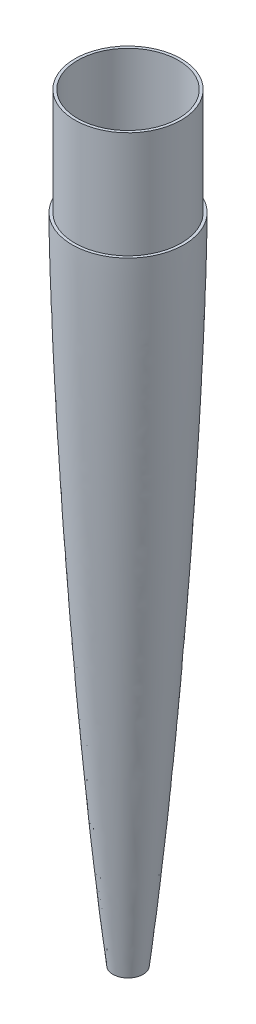
ISO-10303-21;
HEADER;
FILE_DESCRIPTION(('STEP AP214'),'2;1');
FILE_NAME('part.step','',(''),(''),'','','');
FILE_SCHEMA(('AUTOMOTIVE_DESIGN { 1 0 10303 214 1 1 1 1 }'));
ENDSEC;
DATA;
#1=APPLICATION_CONTEXT('core data for automotive mechanical design processes');
#2=APPLICATION_PROTOCOL_DEFINITION('international standard','automotive_design',2000,#1);
#3=PRODUCT_CONTEXT('',#1,'mechanical');
#4=PRODUCT('Part','Part','',(#3));
#5=PRODUCT_RELATED_PRODUCT_CATEGORY('part','',(#4));
#6=PRODUCT_DEFINITION_FORMATION('','',#4);
#7=PRODUCT_DEFINITION_CONTEXT('part definition',#1,'design');
#8=PRODUCT_DEFINITION('design','',#6,#7);
#9=PRODUCT_DEFINITION_SHAPE('','',#8);
#10=(LENGTH_UNIT() NAMED_UNIT(*) SI_UNIT(.MILLI.,.METRE.));
#11=(NAMED_UNIT(*) PLANE_ANGLE_UNIT() SI_UNIT($,.RADIAN.));
#12=(NAMED_UNIT(*) SI_UNIT($,.STERADIAN.) SOLID_ANGLE_UNIT());
#13=UNCERTAINTY_MEASURE_WITH_UNIT(LENGTH_MEASURE(1.E-05),#10,'distance_accuracy_value','');
#14=(GEOMETRIC_REPRESENTATION_CONTEXT(3) GLOBAL_UNCERTAINTY_ASSIGNED_CONTEXT((#13)) GLOBAL_UNIT_ASSIGNED_CONTEXT((#10,
#11,#12)) REPRESENTATION_CONTEXT('',''));
#15=CARTESIAN_POINT('',(0.,0.,0.));
#16=DIRECTION('',(0.,0.,1.));
#17=DIRECTION('',(1.,0.,0.));
#18=AXIS2_PLACEMENT_3D('',#15,#16,#17);
#19=CARTESIAN_POINT('',(-60.0000000001426,-2.33882977510554E-11,0.));
#20=CARTESIAN_POINT('',(-60.0000000001426,-0.801301823903259,0.));
#21=CARTESIAN_POINT('',(-59.9928580137384,-2.1349357584548,0.));
#22=CARTESIAN_POINT('',(-59.98048706967,-4.3958958658182,0.));
#23=CARTESIAN_POINT('',(-59.9625155597859,-6.54462451562829,0.));
#24=CARTESIAN_POINT('',(-59.9427618181557,-8.74990851475878,0.));
#25=CARTESIAN_POINT('',(-59.9190556810735,-10.9254835015043,0.));
#26=CARTESIAN_POINT('',(-59.8940593661104,-13.1167617549581,0.));
#27=CARTESIAN_POINT('',(-59.8661787392133,-15.29954763848,0.));
#28=CARTESIAN_POINT('',(-59.8366212655086,-17.4868351896834,0.));
#29=CARTESIAN_POINT('',(-59.8051467898141,-19.6716673208355,0.));
#30=CARTESIAN_POINT('',(-59.7715414642021,-21.858055355627,0.));
#31=CARTESIAN_POINT('',(-59.7368679079719,-24.043503345796,0.));
#32=CARTESIAN_POINT('',(-59.7000437094373,-26.229650558645,0.));
#33=CARTESIAN_POINT('',(-59.6620449300104,-28.4152688499004,0.));
#34=CARTESIAN_POINT('',(-59.6224596210874,-30.6013278787719,0.));
#35=CARTESIAN_POINT('',(-59.5815472172789,-32.7870030181022,0.));
#36=CARTESIAN_POINT('',(-59.5389950189546,-34.9726963981385,0.));
#37=CARTESIAN_POINT('',(-59.4956077684906,-37.1583850375949,0.));
#38=CARTESIAN_POINT('',(-59.4503029427564,-39.344069040297,0.));
#39=CARTESIAN_POINT('',(-59.4044692333085,-41.5300998257517,0.));
#40=CARTESIAN_POINT('',(-59.3567878930761,-43.7157809333799,0.));
#41=CARTESIAN_POINT('',(-59.3085880236438,-45.9018083331986,0.));
#42=CARTESIAN_POINT('',(-59.2586304339952,-48.0874901655001,0.));
#43=CARTESIAN_POINT('',(-59.208100542883,-50.273187043317,0.));
#44=CARTESIAN_POINT('',(-59.1558193127923,-52.4588646228322,0.));
#45=CARTESIAN_POINT('',(-59.1034951563988,-54.6445690674239,0.));
#46=CARTESIAN_POINT('',(-59.0482764251413,-56.8305619649433,0.));
#47=CARTESIAN_POINT('',(-58.9942749848543,-59.0162769274279,0.));
#48=CARTESIAN_POINT('',(-58.938221442373,-61.2022966325881,0.));
#49=CARTESIAN_POINT('',(-58.8811407687688,-63.3879819464997,0.));
#50=CARTESIAN_POINT('',(-58.8233554435097,-65.5740088559473,0.));
#51=CARTESIAN_POINT('',(-58.7643795238539,-67.7596884776141,0.));
#52=CARTESIAN_POINT('',(-58.7046658089235,-69.9453747720673,0.));
#53=CARTESIAN_POINT('',(-58.6439254550224,-72.1310638736976,0.));
#54=CARTESIAN_POINT('',(-58.5823191423358,-74.3167530881964,0.));
#55=CARTESIAN_POINT('',(-58.5196746992462,-76.5027716878851,0.));
#56=CARTESIAN_POINT('',(-58.4565096049338,-78.6884639844445,0.));
#57=CARTESIAN_POINT('',(-58.3921245336974,-80.8744830566912,0.));
#58=CARTESIAN_POINT('',(-58.3271061189164,-83.0601793843521,0.));
#59=CARTESIAN_POINT('',(-58.2611989825956,-85.2459823288353,0.));
#60=CARTESIAN_POINT('',(-58.1942097134785,-87.4316604340582,0.));
#61=CARTESIAN_POINT('',(-58.1272978017885,-89.6173600697193,0.));
#62=CARTESIAN_POINT('',(-58.058647274675,-91.8032609020406,0.));
#63=CARTESIAN_POINT('',(-57.989251168952,-93.9889448630091,0.));
#64=CARTESIAN_POINT('',(-57.9195041513539,-96.1749746339345,0.));
#65=CARTESIAN_POINT('',(-57.8486431331676,-98.3606579736918,0.));
#66=CARTESIAN_POINT('',(-57.7772454477689,-100.546676496158,0.));
#67=CARTESIAN_POINT('',(-57.705052501431,-102.732368285557,0.));
#68=CARTESIAN_POINT('',(-57.6077629053964,-105.646864010993,0.));
#69=CARTESIAN_POINT('',(-57.5088466656342,-108.561004504788,0.));
#70=CARTESIAN_POINT('',(-57.4086273477614,-111.475463531615,0.));
#71=CARTESIAN_POINT('',(-57.3328510640123,-113.66115828876,0.));
#72=CARTESIAN_POINT('',(-57.2560466834246,-115.847173484675,0.));
#73=CARTESIAN_POINT('',(-57.1790355109594,-118.032871552435,0.));
#74=CARTESIAN_POINT('',(-57.1007108464739,-120.21854719262,0.));
#75=CARTESIAN_POINT('',(-57.0220096983724,-122.404232760358,0.));
#76=CARTESIAN_POINT('',(-56.9428574139941,-124.589926107225,0.));
#77=CARTESIAN_POINT('',(-56.8622963710326,-126.775926430716,0.));
#78=CARTESIAN_POINT('',(-56.7822430773404,-128.961646740361,0.));
#79=CARTESIAN_POINT('',(-56.69969900554,-131.147635148561,0.));
#80=CARTESIAN_POINT('',(-56.6183363476387,-133.333360228407,0.));
#81=CARTESIAN_POINT('',(-56.5354538809803,-135.519371841224,0.));
#82=CARTESIAN_POINT('',(-56.4521327991776,-137.705058585383,0.));
#83=CARTESIAN_POINT('',(-56.3679537478018,-139.890737929485,0.));
#84=CARTESIAN_POINT('',(-56.2832653613789,-142.076429793572,0.));
#85=CARTESIAN_POINT('',(-56.1980146095592,-144.262121160618,0.));
#86=CARTESIAN_POINT('',(-56.1119320151838,-146.448137696724,0.));
#87=CARTESIAN_POINT('',(-56.0255000158001,-148.633833531911,0.));
#88=CARTESIAN_POINT('',(-55.9379169268994,-150.819842926276,0.));
#89=CARTESIAN_POINT('',(-55.8502760090048,-153.005543944562,0.));
#90=CARTESIAN_POINT('',(-55.7613421898042,-155.191213723324,0.));
#91=CARTESIAN_POINT('',(-55.6430511908556,-158.105392465265,0.));
#92=CARTESIAN_POINT('',(-55.5227173389464,-161.019854887884,0.));
#93=CARTESIAN_POINT('',(-55.4016019370509,-163.934321952382,0.));
#94=CARTESIAN_POINT('',(-55.3098720780468,-166.120335129286,0.));
#95=CARTESIAN_POINT('',(-55.2180775713305,-168.306038314739,0.));
#96=CARTESIAN_POINT('',(-55.1248246441248,-170.492033851042,0.));
#97=CARTESIAN_POINT('',(-55.0320823709269,-172.677748721413,0.));
#98=CARTESIAN_POINT('',(-54.9376436985677,-174.863408092444,0.));
#99=CARTESIAN_POINT('',(-54.8436358739179,-177.049121618183,0.));
#100=CARTESIAN_POINT('',(-54.7480381856809,-179.234791681532,0.));
#101=CARTESIAN_POINT('',(-54.6525693742329,-181.420836883498,0.));
#102=CARTESIAN_POINT('',(-54.5564796288478,-183.606533337725,0.));
#103=CARTESIAN_POINT('',(-54.4594759168142,-185.792547103026,0.));
#104=CARTESIAN_POINT('',(-54.3621888187561,-187.978234727026,0.));
#105=CARTESIAN_POINT('',(-54.2642699638647,-190.16392455596,0.));
#106=CARTESIAN_POINT('',(-54.1655876713285,-192.349599765615,0.));
#107=CARTESIAN_POINT('',(-54.0666165077717,-194.535290959152,0.));
#108=CARTESIAN_POINT('',(-53.9667845555566,-196.721302603668,0.));
#109=CARTESIAN_POINT('',(-53.8666939464616,-198.906999552401,0.));
#110=CARTESIAN_POINT('',(-53.7659336435593,-201.093026138364,0.));
#111=CARTESIAN_POINT('',(-53.6647414882667,-203.278718393596,0.));
#112=CARTESIAN_POINT('',(-53.5625740711519,-205.464729688654,0.));
#113=CARTESIAN_POINT('',(-53.4601528699523,-207.650414822693,0.));
#114=CARTESIAN_POINT('',(-53.3574510757487,-209.836114667794,0.));
#115=CARTESIAN_POINT('',(-53.2537901603537,-212.021793326714,0.));
#116=CARTESIAN_POINT('',(-53.149897537093,-214.207484037774,0.));
#117=CARTESIAN_POINT('',(-53.0451898047389,-216.393500975387,0.));
#118=CARTESIAN_POINT('',(-52.939966643264,-218.579191868807,0.));
#119=CARTESIAN_POINT('',(-52.8343461219408,-220.765225660688,0.));
#120=CARTESIAN_POINT('',(-52.7280267396616,-222.950909419819,0.));
#121=CARTESIAN_POINT('',(-52.6215533875681,-225.136604178052,0.));
#122=CARTESIAN_POINT('',(-52.5138485447891,-227.322274149928,0.));
#123=CARTESIAN_POINT('',(-52.4067035801686,-229.508001007102,0.));
#124=CARTESIAN_POINT('',(-52.2971718456873,-231.693961126817,0.));
#125=CARTESIAN_POINT('',(-52.189930067523,-233.879735673017,0.));
#126=CARTESIAN_POINT('',(-52.0790821333443,-236.065676373182,0.));
#127=CARTESIAN_POINT('',(-51.9699108460378,-238.251412967089,0.));
#128=CARTESIAN_POINT('',(-51.859016380281,-240.437401633627,0.));
#129=CARTESIAN_POINT('',(-51.7482654926641,-242.62309987339,0.));
#130=CARTESIAN_POINT('',(-51.6367311034779,-244.80878420912,0.));
#131=CARTESIAN_POINT('',(-51.5245631212694,-246.994461642827,0.));
#132=CARTESIAN_POINT('',(-51.4123396904287,-249.180169949125,0.));
#133=CARTESIAN_POINT('',(-51.298859713644,-251.366169958146,0.));
#134=CARTESIAN_POINT('',(-51.1857817280451,-253.551885484478,0.));
#135=CARTESIAN_POINT('',(-51.0711214018294,-255.737881493273,0.));
#136=CARTESIAN_POINT('',(-50.9569390942525,-257.923591641242,0.));
#137=CARTESIAN_POINT('',(-50.8414000162615,-260.109265018423,0.));
#138=CARTESIAN_POINT('',(-50.7262124583664,-262.294980869557,0.));
#139=CARTESIAN_POINT('',(-50.609806822272,-264.480661756551,0.));
#140=CARTESIAN_POINT('',(-50.49308908074,-266.666677341084,0.));
#141=CARTESIAN_POINT('',(-50.3760721167906,-268.852372888489,0.));
#142=CARTESIAN_POINT('',(-50.2582093000859,-271.038380357899,0.));
#143=CARTESIAN_POINT('',(-50.1401856679186,-273.22408148653,0.));
#144=CARTESIAN_POINT('',(-50.0213310934711,-275.409964495148,0.));
#145=CARTESIAN_POINT('',(-49.9022649791665,-277.59566335085,0.));
#146=CARTESIAN_POINT('',(-49.7825250365863,-279.781345210717,0.));
#147=CARTESIAN_POINT('',(-49.6622228091893,-281.967155960256,0.));
#148=CARTESIAN_POINT('',(-49.5415680818832,-284.152841674381,0.));
#149=CARTESIAN_POINT('',(-49.4202044020147,-286.338856279311,0.));
#150=CARTESIAN_POINT('',(-49.29879834273,-288.524573428303,0.));
#151=CARTESIAN_POINT('',(-49.1758131776726,-290.710555166082,0.));
#152=CARTESIAN_POINT('',(-49.054627888529,-292.89634128272,0.));
#153=CARTESIAN_POINT('',(-48.929555275557,-295.0819193207,0.));
#154=CARTESIAN_POINT('',(-48.8070370902951,-297.267689435649,0.));
#155=CARTESIAN_POINT('',(-48.6822003887957,-299.453344601548,0.));
#156=CARTESIAN_POINT('',(-48.5576225754813,-301.639375739822,0.));
#157=CARTESIAN_POINT('',(-48.4323772675761,-303.825065530557,0.));
#158=CARTESIAN_POINT('',(-48.3066047555773,-306.011076631732,0.));
#159=CARTESIAN_POINT('',(-48.1383015084831,-308.925568974,0.));
#160=CARTESIAN_POINT('',(-47.9687577520782,-311.840024396278,0.));
#161=CARTESIAN_POINT('',(-47.7986506928371,-314.754161782011,0.));
#162=CARTESIAN_POINT('',(-47.6703441668427,-316.93984705093,0.));
#163=CARTESIAN_POINT('',(-47.5416981694353,-319.125548351408,0.));
#164=CARTESIAN_POINT('',(-47.4122260498195,-321.311556796596,0.));
#165=CARTESIAN_POINT('',(-47.2825181369897,-323.49725583261,0.));
#166=CARTESIAN_POINT('',(-47.1525373973757,-325.683293759691,0.));
#167=CARTESIAN_POINT('',(-47.021571672283,-327.86897085692,0.));
#168=CARTESIAN_POINT('',(-46.8905408842905,-330.054672909584,0.));
#169=CARTESIAN_POINT('',(-46.7584380576843,-332.240330723079,0.));
#170=CARTESIAN_POINT('',(-46.6266310928253,-334.426034491435,0.));
#171=CARTESIAN_POINT('',(-46.4937243238761,-336.61203863915,0.));
#172=CARTESIAN_POINT('',(-46.3605376952103,-338.797731393353,0.));
#173=CARTESIAN_POINT('',(-46.226723481971,-340.983758972386,0.));
#174=CARTESIAN_POINT('',(-46.0927320372351,-343.169463312631,0.));
#175=CARTESIAN_POINT('',(-45.9576817373443,-345.35536220314,0.));
#176=CARTESIAN_POINT('',(-45.8228174545693,-347.541074096852,0.));
#177=CARTESIAN_POINT('',(-45.6865401987217,-349.726720561201,0.));
#178=CARTESIAN_POINT('',(-45.5513432772731,-351.912568315546,0.));
#179=CARTESIAN_POINT('',(-45.4139783637046,-354.098210705027,0.));
#180=CARTESIAN_POINT('',(-45.2766032303821,-356.284223197613,0.));
#181=CARTESIAN_POINT('',(-45.139053757908,-358.469936355024,0.));
#182=CARTESIAN_POINT('',(-45.0007636174252,-360.65595561872,0.));
#183=CARTESIAN_POINT('',(-44.8620395396177,-362.841656072797,0.));
#184=CARTESIAN_POINT('',(-44.7229239771186,-365.027353452687,0.));
#185=CARTESIAN_POINT('',(-44.5829993617357,-367.213025930005,0.));
#186=CARTESIAN_POINT('',(-44.4430975902686,-369.398736620572,0.));
#187=CARTESIAN_POINT('',(-44.3019143011011,-371.584719330782,0.));
#188=CARTESIAN_POINT('',(-44.1609355430731,-373.770425311797,0.));
#189=CARTESIAN_POINT('',(-44.0192091388467,-375.956439275347,0.));
#190=CARTESIAN_POINT('',(-43.8767695109639,-378.142115164225,0.));
#191=CARTESIAN_POINT('',(-43.7342188373913,-380.327899791931,0.));
#192=CARTESIAN_POINT('',(-43.5909388349971,-382.513586347097,0.));
#193=CARTESIAN_POINT('',(-43.4470885855536,-384.69926936018,0.));
#194=CARTESIAN_POINT('',(-43.3028463807902,-386.885214629417,0.));
#195=CARTESIAN_POINT('',(-43.1580368686497,-389.070907079514,0.));
#196=CARTESIAN_POINT('',(-43.0129135060253,-391.256947279226,0.));
#197=CARTESIAN_POINT('',(-42.8668906159445,-393.442611194814,0.));
#198=CARTESIAN_POINT('',(-42.720711355889,-395.628637303506,0.));
#199=CARTESIAN_POINT('',(-42.5737985495696,-397.814315116601,0.));
#200=CARTESIAN_POINT('',(-42.4264909971222,-400.000021170648,0.));
#201=CARTESIAN_POINT('',(-42.278628488129,-402.185713002157,0.));
#202=CARTESIAN_POINT('',(-42.1302547607546,-404.371392804027,0.));
#203=CARTESIAN_POINT('',(-41.9815686150264,-406.557429677199,0.));
#204=CARTESIAN_POINT('',(-41.8316813939101,-408.743075026994,0.));
#205=CARTESIAN_POINT('',(-41.682828376469,-410.929168220404,0.));
#206=CARTESIAN_POINT('',(-41.531510492672,-413.114784676456,0.));
#207=CARTESIAN_POINT('',(-41.330439397009,-416.029298351876,0.));
#208=CARTESIAN_POINT('',(-41.1280562236095,-418.943436932351,0.));
#209=CARTESIAN_POINT('',(-40.9246635921915,-421.857882421225,0.));
#210=CARTESIAN_POINT('',(-40.7717445473838,-424.043579314779,0.));
#211=CARTESIAN_POINT('',(-40.618076427697,-426.229594609859,0.));
#212=CARTESIAN_POINT('',(-40.4640090975347,-428.415295234015,0.));
#213=CARTESIAN_POINT('',(-40.3092052149937,-430.601315556277,0.));
#214=CARTESIAN_POINT('',(-40.1543121274528,-432.787028348847,0.));
#215=CARTESIAN_POINT('',(-39.9986394404266,-434.972710046305,0.));
#216=CARTESIAN_POINT('',(-39.8421529131264,-437.158365607462,0.));
#217=CARTESIAN_POINT('',(-39.6858148248248,-439.344094129345,0.));
#218=CARTESIAN_POINT('',(-39.5280872402263,-441.530081543914,0.));
#219=CARTESIAN_POINT('',(-39.3706949129096,-443.715806358806,0.));
#220=CARTESIAN_POINT('',(-39.211862326865,-445.901785528701,0.));
#221=CARTESIAN_POINT('',(-39.053403334932,-448.087522124287,0.));
#222=CARTESIAN_POINT('',(-38.8936395167089,-450.273297546757,0.));
#223=CARTESIAN_POINT('',(-38.7337380957885,-452.458987048213,0.));
#224=CARTESIAN_POINT('',(-38.5732261069395,-454.644664913847,0.));
#225=CARTESIAN_POINT('',(-38.4120894098505,-456.830568481253,0.));
#226=CARTESIAN_POINT('',(-38.2506435523755,-459.016289263127,0.));
#227=CARTESIAN_POINT('',(-38.0881180053369,-461.202280634811,0.));
#228=CARTESIAN_POINT('',(-37.9257339913548,-463.388006805025,0.));
#229=CARTESIAN_POINT('',(-37.7620331723076,-465.573994827819,0.));
#230=CARTESIAN_POINT('',(-37.5979601773359,-467.759671106039,0.));
#231=CARTESIAN_POINT('',(-37.4343339468985,-469.945406433381,0.));
#232=CARTESIAN_POINT('',(-37.268766085884,-472.131043432724,0.));
#233=CARTESIAN_POINT('',(-37.1036243750303,-474.316764751327,0.));
#234=CARTESIAN_POINT('',(-36.9372771622139,-476.502778387763,0.));
#235=CARTESIAN_POINT('',(-36.7706774759445,-478.688464011327,0.));
#236=CARTESIAN_POINT('',(-36.6033394091119,-480.874477936009,0.));
#237=CARTESIAN_POINT('',(-36.435566057118,-483.060176559768,0.));
#238=CARTESIAN_POINT('',(-36.2672087585891,-485.245881681873,0.));
#239=CARTESIAN_POINT('',(-36.0980106332588,-487.431559842726,0.));
#240=CARTESIAN_POINT('',(-35.9287474448799,-489.617272101659,0.));
#241=CARTESIAN_POINT('',(-35.7583039160312,-491.803273104809,0.));
#242=CARTESIAN_POINT('',(-35.5877256691374,-493.988973653864,0.));
#243=CARTESIAN_POINT('',(-35.4164066938193,-496.174992389819,0.));
#244=CARTESIAN_POINT('',(-35.2444338203065,-498.360674998629,0.));
#245=CARTESIAN_POINT('',(-35.0720491175363,-500.54671087537,0.));
#246=CARTESIAN_POINT('',(-34.8989221461519,-502.732404614787,0.));
#247=CARTESIAN_POINT('',(-34.6671510470462,-505.64690235392,0.));
#248=CARTESIAN_POINT('',(-34.4345682895884,-508.561067681634,0.));
#249=CARTESIAN_POINT('',(-34.2003137689613,-511.47547722318,0.));
#250=CARTESIAN_POINT('',(-34.0243049150133,-513.661157965156,0.));
#251=CARTESIAN_POINT('',(-33.847353495738,-515.847147357368,0.));
#252=CARTESIAN_POINT('',(-33.6707798241379,-518.032918232453,0.));
#253=CARTESIAN_POINT('',(-33.491732111915,-520.218664230032,0.));
#254=CARTESIAN_POINT('',(-33.3135726894505,-522.404386437535,0.));
#255=CARTESIAN_POINT('',(-33.1342374505945,-524.590066145442,0.));
#256=CARTESIAN_POINT('',(-32.9541586095964,-526.775947697873,0.));
#257=CARTESIAN_POINT('',(-32.7740060642861,-528.961669566137,0.));
#258=CARTESIAN_POINT('',(-32.5924047396345,-531.147650911363,0.));
#259=CARTESIAN_POINT('',(-32.4109221593613,-533.333354764368,0.));
#260=CARTESIAN_POINT('',(-32.2281958254109,-535.519362339642,0.));
#261=CARTESIAN_POINT('',(-32.0451386282556,-537.705064648834,0.));
#262=CARTESIAN_POINT('',(-31.8612067136071,-539.890749257475,0.));
#263=CARTESIAN_POINT('',(-31.6766894202793,-542.07644009901,0.));
#264=CARTESIAN_POINT('',(-31.4919505474606,-544.262152096812,0.));
#265=CARTESIAN_POINT('',(-31.3059243606227,-546.448161537799,0.));
#266=CARTESIAN_POINT('',(-31.1193298979666,-548.633846995216,0.));
#267=CARTESIAN_POINT('',(-30.9323226190577,-550.819875434141,0.));
#268=CARTESIAN_POINT('',(-30.7445079052971,-553.005570213811,0.));
#269=CARTESIAN_POINT('',(-30.5559778059362,-555.191260581758,0.));
#270=CARTESIAN_POINT('',(-30.3665252697071,-557.376929049005,0.));
#271=CARTESIAN_POINT('',(-30.177192953463,-559.562665124149,0.));
#272=CARTESIAN_POINT('',(-29.9856661107267,-561.748602994127,0.));
#273=CARTESIAN_POINT('',(-29.7949438472541,-563.93436666999,0.));
#274=CARTESIAN_POINT('',(-29.60271310474,-566.12035751395,0.));
#275=CARTESIAN_POINT('',(-29.4099258686427,-568.30605043682,0.));
#276=CARTESIAN_POINT('',(-29.2165092593951,-570.492084484009,0.));
#277=CARTESIAN_POINT('',(-29.0220526397938,-572.677756941995,0.));
#278=CARTESIAN_POINT('',(-28.8273214732821,-574.863463768647,0.));
#279=CARTESIAN_POINT('',(-28.6313195462842,-577.049111422092,0.));
#280=CARTESIAN_POINT('',(-28.4352424863828,-579.234842067104,0.));
#281=CARTESIAN_POINT('',(-28.2374505871816,-581.42081196627,0.));
#282=CARTESIAN_POINT('',(-28.0397753253466,-583.60653410481,0.));
#283=CARTESIAN_POINT('',(-27.8408288872496,-585.79254919582,0.));
#284=CARTESIAN_POINT('',(-27.6413637713897,-587.978245938478,0.));
#285=CARTESIAN_POINT('',(-27.4410685179048,-590.163943402037,0.));
#286=CARTESIAN_POINT('',(-27.2398178562391,-592.34962824257,0.));
#287=CARTESIAN_POINT('',(-27.0380143004242,-594.5353475194,0.));
#288=CARTESIAN_POINT('',(-26.8348439590993,-596.721325459358,0.));
#289=CARTESIAN_POINT('',(-26.6319312691102,-598.907071959337,0.));
#290=CARTESIAN_POINT('',(-26.4266372446579,-601.092994457748,0.));
#291=CARTESIAN_POINT('',(-26.2222154483989,-603.278758693939,0.));
#292=CARTESIAN_POINT('',(-26.0156441943186,-605.464715599942,0.));
#293=CARTESIAN_POINT('',(-25.8089380961609,-607.65042041216,0.));
#294=CARTESIAN_POINT('',(-25.601048982736,-609.836107743338,0.));
#295=CARTESIAN_POINT('',(-25.392425955521,-612.021819265265,0.));
#296=CARTESIAN_POINT('',(-25.1829436813243,-614.207535647025,0.));
#297=CARTESIAN_POINT('',(-24.9723007087388,-616.393547962759,0.));
#298=CARTESIAN_POINT('',(-24.7611808210798,-618.57924577508,0.));
#299=CARTESIAN_POINT('',(-24.5487305796642,-620.765243182958,0.));
#300=CARTESIAN_POINT('',(-24.3356104945879,-622.950940724081,0.));
#301=CARTESIAN_POINT('',(-24.1216753918064,-625.136655174358,0.));
#302=CARTESIAN_POINT('',(-23.9062995982351,-627.322305822836,0.));
#303=CARTESIAN_POINT('',(-23.690750483091,-629.508036765034,0.));
#304=CARTESIAN_POINT('',(-23.4730885308975,-631.693979901769,0.));
#305=CARTESIAN_POINT('',(-23.2562981170144,-633.87979890036,0.));
#306=CARTESIAN_POINT('',(-23.0363393336809,-636.065712516858,0.));
#307=CARTESIAN_POINT('',(-22.8167900666531,-638.251465366027,0.));
#308=CARTESIAN_POINT('',(-22.5955680413042,-640.437451396446,0.));
#309=CARTESIAN_POINT('',(-22.3738278399331,-642.623161305544,0.));
#310=CARTESIAN_POINT('',(-22.1506360616215,-644.808818844091,0.));
#311=CARTESIAN_POINT('',(-21.9265178786807,-646.994501180361,0.));
#312=CARTESIAN_POINT('',(-21.7017332416382,-649.180231975543,0.));
#313=CARTESIAN_POINT('',(-21.4749314931274,-651.366192350418,0.));
#314=CARTESIAN_POINT('',(-21.248017068061,-653.55194309263,0.));
#315=CARTESIAN_POINT('',(-21.0190297252906,-655.73791898112,0.));
#316=CARTESIAN_POINT('',(-20.7898296221293,-657.923669498659,0.));
#317=CARTESIAN_POINT('',(-20.4815753158999,-660.838186302885,0.));
#318=CARTESIAN_POINT('',(-20.1718623797792,-663.752385106934,0.));
#319=CARTESIAN_POINT('',(-19.8592637510067,-666.666750242085,0.));
#320=CARTESIAN_POINT('',(-19.6237589460801,-668.85244095264,0.));
#321=CARTESIAN_POINT('',(-19.3866685236535,-671.038438196834,0.));
#322=CARTESIAN_POINT('',(-19.1486219673028,-673.224159458927,0.));
#323=CARTESIAN_POINT('',(-18.9088537285691,-675.410154942395,0.));
#324=CARTESIAN_POINT('',(-18.6683835849651,-677.595878389489,0.));
#325=CARTESIAN_POINT('',(-18.4259740998069,-679.781542734059,0.));
#326=CARTESIAN_POINT('',(-18.1825492400415,-681.967245551374,0.));
#327=CARTESIAN_POINT('',(-17.9375573183851,-684.152919887927,0.));
#328=CARTESIAN_POINT('',(-17.6911347916404,-686.338934942193,0.));
#329=CARTESIAN_POINT('',(-17.3604681351081,-689.253500161297,0.));
#330=CARTESIAN_POINT('',(-17.0270922608004,-692.168023286685,0.));
#331=CARTESIAN_POINT('',(-16.6902907547624,-695.082034685614,0.));
#332=CARTESIAN_POINT('',(-16.4363601217639,-697.267741078892,0.));
#333=CARTESIAN_POINT('',(-16.2573965024762,-698.797019740746,0.));
#334=CARTESIAN_POINT('',(-16.1633521054096,-699.597879120112,0.));
#335=CARTESIAN_POINT('',(-16.1548803003542,-699.67,0.));
#336=B_SPLINE_CURVE_WITH_KNOTS('',3,(#19,#20,#21,#22,#23,#24,#25,#26,#27,#28,#29,#30,#31,#32,
#33,#34,#35,#36,#37,#38,#39,#40,#41,#42,#43,#44,#45,#46,#47,#48,#49,#50,#51,#52,#53,#54,#55,#56,
#57,#58,#59,#60,#61,#62,#63,#64,#65,#66,#67,#68,#69,#70,#71,#72,#73,#74,#75,#76,#77,#78,#79,#80,
#81,#82,#83,#84,#85,#86,#87,#88,#89,#90,#91,#92,#93,#94,#95,#96,#97,#98,#99,#100,#101,#102,#103,
#104,#105,#106,#107,#108,#109,#110,#111,#112,#113,#114,#115,#116,#117,#118,#119,#120,#121,#122,
#123,#124,#125,#126,#127,#128,#129,#130,#131,#132,#133,#134,#135,#136,#137,#138,#139,#140,#141,
#142,#143,#144,#145,#146,#147,#148,#149,#150,#151,#152,#153,#154,#155,#156,#157,#158,#159,#160,
#161,#162,#163,#164,#165,#166,#167,#168,#169,#170,#171,#172,#173,#174,#175,#176,#177,#178,#179,
#180,#181,#182,#183,#184,#185,#186,#187,#188,#189,#190,#191,#192,#193,#194,#195,#196,#197,#198,
#199,#200,#201,#202,#203,#204,#205,#206,#207,#208,#209,#210,#211,#212,#213,#214,#215,#216,#217,
#218,#219,#220,#221,#222,#223,#224,#225,#226,#227,#228,#229,#230,#231,#232,#233,#234,#235,#236,
#237,#238,#239,#240,#241,#242,#243,#244,#245,#246,#247,#248,#249,#250,#251,#252,#253,#254,#255,
#256,#257,#258,#259,#260,#261,#262,#263,#264,#265,#266,#267,#268,#269,#270,#271,#272,#273,#274,
#275,#276,#277,#278,#279,#280,#281,#282,#283,#284,#285,#286,#287,#288,#289,#290,#291,#292,#293,
#294,#295,#296,#297,#298,#299,#300,#301,#302,#303,#304,#305,#306,#307,#308,#309,#310,#311,#312,
#313,#314,#315,#316,#317,#318,#319,#320,#321,#322,#323,#324,#325,#326,#327,#328,#329,#330,#331,
#332,#333,#334,#335),.UNSPECIFIED.,.F.,.F.,(4,1,1,1,1,1,1,1,1,1,1,1,1,1,1,1,1,1,1,1,1,1,1,1,1,1,
1,1,1,1,1,1,1,1,1,1,1,1,1,1,1,1,1,1,1,1,1,1,1,1,1,1,1,1,1,1,1,1,1,1,1,1,1,1,1,1,1,1,1,1,1,1,1,1,
1,1,1,1,1,1,1,1,1,1,1,1,1,1,1,1,1,1,1,1,1,1,1,1,1,1,1,1,1,1,1,1,1,1,1,1,1,1,1,1,1,1,1,1,1,1,1,1,
1,1,1,1,1,1,1,1,1,1,1,1,1,1,1,1,1,1,1,1,1,1,1,1,1,1,1,1,1,1,1,1,1,1,1,1,1,1,1,1,1,1,1,1,1,1,1,1,
1,1,1,1,1,1,1,1,1,1,1,1,1,1,1,1,1,1,1,1,1,1,1,1,1,1,1,1,1,1,1,1,1,1,1,1,1,1,1,1,1,1,1,1,1,1,1,1,
1,1,1,1,1,1,1,1,1,1,1,1,1,1,1,1,1,1,1,1,1,1,1,1,1,1,1,1,1,1,1,1,1,1,1,1,1,1,1,1,1,1,1,1,1,1,1,1,
1,1,1,1,1,1,1,1,1,1,1,1,1,1,1,1,1,1,1,1,1,1,1,1,1,1,1,1,1,1,1,1,1,1,1,1,1,1,1,1,1,1,1,1,1,1,1,1,
4),(0.,0.00272131496001993,0.005443894589517,0.00816527930455702,0.01088794055321,
0.013609388196854,0.0163321111533959,0.0190536166847319,0.021775486742186,0.024497974052231,
0.027219599903839,0.029942491664498,0.0326641597735251,0.0353871165415079,0.0381088519966331,
0.040831860483443,0.043553665767376,0.046275496349642,0.048998613768099,0.051720527314018,
0.054443712517128,0.0571656666147861,0.059888920028736,0.062610955825131,0.065333013497142,
0.06805633930897,0.0707784747361541,0.073501855013806,0.076224025449267,0.078947510534478,
0.081669750986491,0.0843932710799791,0.087115584035472,0.0898379270253891,0.092561565726153,
0.095283969263172,0.098007652441665,0.100730125995237,0.103453879190283,0.106176422760409,
0.108899388009542,0.111622789542135,0.114345403128814,0.117069304128237,0.119792003274009,
0.122515947052977,0.125238701367999,0.127962718316356,0.130685545800765,0.136132527423723,
0.138855425856723,0.141579611437069,0.144302595429162,0.147026823789055,0.149749850560693,
0.152472920111878,0.155197234030863,0.157920346361593,0.16064474583967,0.163367943729493,
0.166092385987115,0.168815634422752,0.171540127226189,0.174263426207641,0.176986775734906,
0.179711392831328,0.182434775641494,0.185159464376311,0.187882936953633,0.190607665223226,
0.193331212238236,0.196054763948758,0.201503212515798,0.204228128844883,0.206951814929934,
0.209676745382784,0.212400514329826,0.215125513244695,0.217849316717566,0.220573138143869,
0.223298270466543,0.226022158734851,0.228747349363704,0.231471295938191,0.234196523207539,
0.236920549753889,0.239644612940735,0.242369920181946,0.245094056968394,0.247819465528539,
0.250543645327743,0.253269127487491,0.255993365592873,0.25871890569744,0.261443214534909,
0.264167556826742,0.266893186142949,0.269617579253557,0.272343283284512,0.275067784086313,
0.277793527943894,0.280518047225248,0.283242615254393,0.285968485282721,0.288693111618044,
0.291418981646373,0.294143732347617,0.296869660682125,0.299594439900962,0.302320471837359,
0.305045288598344,0.307770171419071,0.310496302264589,0.313221246813271,0.315947464655498,
0.31867245703432,0.321398759165889,0.324123817604452,0.326848941019811,0.329575331363347,
0.332300500442953,0.335026935235478,0.337752191311793,0.340478691213425,0.343204013890954,
0.345930114470123,0.348655968589598,0.351381361117181,0.354108055407725,0.356833510204737,
0.359560274345334,0.362285861261829,0.365012625402427,0.367738286124528,0.370463913775264,
0.373190850852575,0.375916585380282,0.378643562735014,0.381369371068329,0.384096422685488,
0.3895494421448,0.392275386191702,0.395001377425796,0.397728624796121,0.400454703145029,
0.403182024320961,0.405908168207634,0.408635571913834,0.411361766214172,0.414088017381125,
0.41681549262122,0.419541792386947,0.422269408785305,0.424995782356638,0.427723472560603,
0.430449919937543,0.433177255920501,0.43590420558648,0.438630726769026,0.441358564584204,
0.44408524111524,0.446813160473301,0.449539918547222,0.452267919448167,0.454994756168639,
0.457721598681775,0.460449704073464,0.46317667892669,0.465904847310566,0.468631870955846,
0.471360177085618,0.474087261331073,0.476814715754104,0.479542835734776,0.482270046304863,
0.484998573224247,0.48772589118141,0.490454473295164,0.493181817096519,0.495910524034072,
0.498637988144601,0.501365533798013,0.504094321774129,0.506821867427542,0.509550818489425,
0.512278445685721,0.515007396747605,0.517735194757472,0.523192122370598,0.525920017212331,
0.528649228525098,0.531377240930961,0.534106518586972,0.536834668313591,0.539564065728912,
0.542292223992346,0.545020465184834,0.547749983335101,0.550478374775522,0.553207950732218,
0.555936402905975,0.558666126363776,0.561394697321208,0.564123644881337,0.566853084421854,
0.569581775138595,0.572311732505109,0.575040571274604,0.577770562544467,0.580499490584649,
0.583229660395887,0.585958588436068,0.588687613464388,0.591417977251901,0.594147099268359,
0.59687756004401,0.599606779048606,0.602337336213611,0.605066749194483,0.607796162175354,
0.610526865156356,0.613256423884428,0.615987254592978,0.618716879569779,0.621447837407092,
0.624177605216151,0.626908667726453,0.629638565648015,0.635099740725757,0.637829799499231,
0.640561099444975,0.643291255206585,0.646022749128606,0.648753106572715,0.651483928608631,
0.654215066065807,0.656945629466037,0.659677437471138,0.66240800516212,0.665139986799673,
0.667870727264954,0.670602814667454,0.673333762805155,0.676064712659158,0.678797007734078,
0.681528102329464,0.684260566746082,0.686991830683167,0.689724335146809,0.692455808472614,
0.695187281798419,0.697919995650782,0.700651678365309,0.703384601606392,0.706116396709408,
0.708849432338979,0.71158143655828,0.714314711933095,0.717046751772791,0.719778976470055,
0.72251246165358,0.725244835895089,0.727978527967113,0.730711050217506,0.733444945878512,
0.736177625657032,0.738910432256442,0.741644602747222,0.744377595739562,0.747111828566034,
0.749845046335349,0.752579503938797,0.755312841777774,0.758047546081726,0.760781117498837,
0.763514815546793,0.76624987349854,0.76898377428707,0.771718988968326,0.77445304788138,
0.777188544365472,0.779922883113006,0.782657299282507,0.785393079209731,0.788127773573416,
0.790863750336148,0.793598735810326,0.796334959594622,0.799070191817639,0.801806680586304,
0.804542081031301,0.807277673430839,0.810014608144955,0.812750444152257,0.81548766199917,
0.818223866210184,0.820961324523787,0.8236977992162,0.829172385427624,0.831909258636518,
0.834647505545258,0.837384784923341,0.84012343800127,0.842861051414669,0.845600046574857,
0.848337973678122,0.851076154544651,0.853815708279953,0.85655415992594,0.859294194018069,
0.86477356224164,0.867513015076243,0.870252618362687,0.872993688909168,0.873264965027392),.UNSPECIFIED.);
#337=CARTESIAN_POINT('',(0.,-789.447198400161,0.));
#338=DIRECTION('',(0.,-1.,0.));
#339=AXIS1_PLACEMENT('',#337,#338);
#340=SURFACE_OF_REVOLUTION('',#336,#339);
#341=CARTESIAN_POINT('',(0.,-699.67,0.));
#342=DIRECTION('',(0.,-1.,0.));
#343=DIRECTION('',(1.,0.,0.));
#344=AXIS2_PLACEMENT_3D('',#341,#342,#343);
#345=CIRCLE('',#344,16.1548803003542);
#346=CARTESIAN_POINT('',(16.1548803003541,-699.67,0.));
#347=VERTEX_POINT('',#346);
#348=EDGE_CURVE('E79',#347,#347,#345,.T.);
#349=ORIENTED_EDGE('',*,*,#348,.F.);
#350=EDGE_LOOP('',(#349));
#351=FACE_BOUND('',#350,.T.);
#352=CARTESIAN_POINT('',(0.,-2.34257058195908E-11,0.));
#353=DIRECTION('',(0.,-1.,0.));
#354=DIRECTION('',(1.,0.,0.));
#355=AXIS2_PLACEMENT_3D('',#352,#353,#354);
#356=CIRCLE('',#355,60.0000000001427);
#357=CARTESIAN_POINT('',(60.0000000001428,-2.34325276683924E-11,0.));
#358=VERTEX_POINT('',#357);
#359=EDGE_CURVE('E10',#358,#358,#356,.T.);
#360=ORIENTED_EDGE('',*,*,#359,.T.);
#361=EDGE_LOOP('',(#360));
#362=FACE_BOUND('',#361,.T.);
#363=ADVANCED_FACE('F39',(#351,#362),#340,.T.);
#364=CARTESIAN_POINT('',(-60.0000000001426,-2.32774108444691E-11,0.));
#365=DIRECTION('',(0.,-1.,0.));
#366=DIRECTION('',(1.,0.,0.));
#367=AXIS2_PLACEMENT_3D('',#364,#365,#366);
#368=PLANE('',#367);
#369=ORIENTED_EDGE('',*,*,#359,.F.);
#370=EDGE_LOOP('',(#369));
#371=FACE_BOUND('',#370,.T.);
#372=CARTESIAN_POINT('',(0.,-2.32036612146658E-11,0.));
#373=DIRECTION('',(0.,-1.,0.));
#374=DIRECTION('',(1.,0.,0.));
#375=AXIS2_PLACEMENT_3D('',#372,#373,#374);
#376=CIRCLE('',#375,57.0300000047233);
#377=CARTESIAN_POINT('',(57.0300000047234,-2.32101453819523E-11,0.));
#378=VERTEX_POINT('',#377);
#379=EDGE_CURVE('E47',#378,#378,#376,.T.);
#380=ORIENTED_EDGE('',*,*,#379,.T.);
#381=EDGE_LOOP('',(#380));
#382=FACE_BOUND('',#381,.T.);
#383=ADVANCED_FACE('F114',(#371,#382),#368,.F.);
#384=CARTESIAN_POINT('',(0.,-789.447198400161,0.));
#385=DIRECTION('',(0.,-1.,0.));
#386=DIRECTION('',(1.,0.,0.));
#387=AXIS2_PLACEMENT_3D('',#384,#385,#386);
#388=CYLINDRICAL_SURFACE('',#387,57.0300000047233);
#389=ORIENTED_EDGE('',*,*,#379,.F.);
#390=EDGE_LOOP('',(#389));
#391=FACE_BOUND('',#390,.T.);
#392=CARTESIAN_POINT('',(0.,114.30000000055,0.));
#393=DIRECTION('',(0.,-1.,0.));
#394=DIRECTION('',(1.,0.,0.));
#395=AXIS2_PLACEMENT_3D('',#392,#393,#394);
#396=CIRCLE('',#395,57.0300000047233);
#397=CARTESIAN_POINT('',(57.0300000047234,114.30000000055,0.));
#398=VERTEX_POINT('',#397);
#399=EDGE_CURVE('E52',#398,#398,#396,.T.);
#400=ORIENTED_EDGE('',*,*,#399,.T.);
#401=EDGE_LOOP('',(#400));
#402=FACE_BOUND('',#401,.T.);
#403=ADVANCED_FACE('F111',(#391,#402),#388,.T.);
#404=CARTESIAN_POINT('',(-57.0300000047232,114.30000000055,0.));
#405=DIRECTION('',(0.,-1.,0.));
#406=DIRECTION('',(1.,0.,0.));
#407=AXIS2_PLACEMENT_3D('',#404,#405,#406);
#408=PLANE('',#407);
#409=ORIENTED_EDGE('',*,*,#399,.F.);
#410=EDGE_LOOP('',(#409));
#411=FACE_BOUND('',#410,.T.);
#412=CARTESIAN_POINT('',(0.,114.30000000055,0.));
#413=DIRECTION('',(0.,-1.,0.));
#414=DIRECTION('',(1.,0.,0.));
#415=AXIS2_PLACEMENT_3D('',#412,#413,#414);
#416=CIRCLE('',#415,54.0600000047233);
#417=CARTESIAN_POINT('',(54.0600000047234,114.30000000055,0.));
#418=VERTEX_POINT('',#417);
#419=EDGE_CURVE('E57',#418,#418,#416,.T.);
#420=ORIENTED_EDGE('',*,*,#419,.T.);
#421=EDGE_LOOP('',(#420));
#422=FACE_BOUND('',#421,.T.);
#423=ADVANCED_FACE('F107',(#411,#422),#408,.F.);
#424=CARTESIAN_POINT('',(0.,-789.447198400161,0.));
#425=DIRECTION('',(0.,-1.,0.));
#426=DIRECTION('',(1.,0.,0.));
#427=AXIS2_PLACEMENT_3D('',#424,#425,#426);
#428=CYLINDRICAL_SURFACE('',#427,54.0600000047233);
#429=ORIENTED_EDGE('',*,*,#419,.F.);
#430=EDGE_LOOP('',(#429));
#431=FACE_BOUND('',#430,.T.);
#432=CARTESIAN_POINT('',(0.,5.50226531004228E-10,0.));
#433=DIRECTION('',(0.,-1.,0.));
#434=DIRECTION('',(1.,0.,0.));
#435=AXIS2_PLACEMENT_3D('',#432,#433,#434);
#436=CIRCLE('',#435,54.0600000047233);
#437=CARTESIAN_POINT('',(54.0600000047234,5.50220384518457E-10,0.));
#438=VERTEX_POINT('',#437);
#439=EDGE_CURVE('E63',#438,#438,#436,.T.);
#440=ORIENTED_EDGE('',*,*,#439,.T.);
#441=EDGE_LOOP('',(#440));
#442=FACE_BOUND('',#441,.T.);
#443=ADVANCED_FACE('F103',(#431,#442),#428,.F.);
#444=CARTESIAN_POINT('',(0.,-95.2674207243951,0.));
#445=DIRECTION('',(0.,-1.,0.));
#446=DIRECTION('',(1.,0.,0.));
#447=AXIS2_PLACEMENT_3D('',#444,#445,#446);
#448=CONICAL_SURFACE('',#447,54.9768996781664,0.00962418586572439);
#449=ORIENTED_EDGE('',*,*,#439,.F.);
#450=EDGE_LOOP('',(#449));
#451=FACE_BOUND('',#450,.T.);
#452=CARTESIAN_POINT('',(0.,-95.2674207243951,0.));
#453=DIRECTION('',(0.,-1.,0.));
#454=DIRECTION('',(1.,0.,0.));
#455=AXIS2_PLACEMENT_3D('',#452,#453,#454);
#456=CIRCLE('',#455,54.9768996781664);
#457=CARTESIAN_POINT('',(54.9768996781664,-95.2674207243951,0.));
#458=VERTEX_POINT('',#457);
#459=EDGE_CURVE('E67',#458,#458,#456,.T.);
#460=ORIENTED_EDGE('',*,*,#459,.T.);
#461=EDGE_LOOP('',(#460));
#462=FACE_BOUND('',#461,.T.);
#463=ADVANCED_FACE('F98',(#451,#462),#448,.F.);
#464=CARTESIAN_POINT('',(-13.5025278445428,-696.782430891007,0.));
#465=CARTESIAN_POINT('',(-13.6291034235742,-695.696740321813,0.));
#466=CARTESIAN_POINT('',(-13.9927654525216,-692.562507302628,0.));
#467=CARTESIAN_POINT('',(-16.063745056623,-674.473253853327,0.));
#468=CARTESIAN_POINT('',(-19.6282864783221,-641.041699053874,0.));
#469=CARTESIAN_POINT('',(-24.2468663188891,-593.195799190774,0.));
#470=CARTESIAN_POINT('',(-28.6013075515189,-543.867289655978,0.));
#471=CARTESIAN_POINT('',(-32.6179771456089,-494.507030378705,0.));
#472=CARTESIAN_POINT('',(-36.3366756206071,-445.12110293931,0.));
#473=CARTESIAN_POINT('',(-40.9296948167045,-379.246418027282,0.));
#474=CARTESIAN_POINT('',(-46.0240792419476,-296.85870434622,0.));
#475=CARTESIAN_POINT('',(-50.2759704484595,-214.422054540594,0.));
#476=CARTESIAN_POINT('',(-53.0779559613628,-149.281209118458,0.));
#477=CARTESIAN_POINT('',(-54.3348672153517,-115.057444063289,0.));
#478=CARTESIAN_POINT('',(-54.9109183522261,-97.3295536156879,0.));
#479=CARTESIAN_POINT('',(-54.9768996781663,-95.2674207243951,0.));
#480=B_SPLINE_CURVE_WITH_KNOTS('',3,(#464,#465,#466,#467,#468,#469,#470,#471,#472,#473,#474,
#475,#476,#477,#478,#479),.UNSPECIFIED.,.F.,.F.,(4,1,1,1,1,1,1,1,1,1,1,1,1,4),
(0.118780058480211,0.122867517315568,0.130578995380839,0.186862170020404,0.248553994542575,
0.310245819064746,0.371937643586918,0.433629468109089,0.49532129263126,0.618704941675603,
0.742088590719945,0.803780415242117,0.862364352265211,0.870075830328419),.UNSPECIFIED.);
#481=CARTESIAN_POINT('',(0.,-789.447198400161,0.));
#482=DIRECTION('',(0.,-1.,0.));
#483=AXIS1_PLACEMENT('',#481,#482);
#484=SURFACE_OF_REVOLUTION('',#480,#483);
#485=ORIENTED_EDGE('',*,*,#459,.F.);
#486=EDGE_LOOP('',(#485));
#487=FACE_BOUND('',#486,.T.);
#488=CARTESIAN_POINT('',(0.,-696.782430891007,0.));
#489=DIRECTION('',(0.,-1.,0.));
#490=DIRECTION('',(1.,0.,0.));
#491=AXIS2_PLACEMENT_3D('',#488,#489,#490);
#492=CIRCLE('',#491,13.5025278445428);
#493=CARTESIAN_POINT('',(13.5025278445428,-696.782430891007,0.));
#494=VERTEX_POINT('',#493);
#495=EDGE_CURVE('E71',#494,#494,#492,.T.);
#496=ORIENTED_EDGE('',*,*,#495,.T.);
#497=EDGE_LOOP('',(#496));
#498=FACE_BOUND('',#497,.T.);
#499=ADVANCED_FACE('F93',(#487,#498),#484,.T.);
#500=CARTESIAN_POINT('',(0.,-699.67,0.));
#501=DIRECTION('',(0.,1.,0.));
#502=DIRECTION('',(-1.,0.,0.));
#503=AXIS2_PLACEMENT_3D('',#500,#501,#502);
#504=CONICAL_SURFACE('',#503,13.1644387650405,0.116553656750119);
#505=ORIENTED_EDGE('',*,*,#495,.F.);
#506=EDGE_LOOP('',(#505));
#507=FACE_BOUND('',#506,.T.);
#508=CARTESIAN_POINT('',(0.,-699.67,0.));
#509=DIRECTION('',(0.,-1.,0.));
#510=DIRECTION('',(1.,0.,0.));
#511=AXIS2_PLACEMENT_3D('',#508,#509,#510);
#512=CIRCLE('',#511,13.1644387650405);
#513=CARTESIAN_POINT('',(13.1644387650404,-699.67,0.));
#514=VERTEX_POINT('',#513);
#515=EDGE_CURVE('E75',#514,#514,#512,.T.);
#516=ORIENTED_EDGE('',*,*,#515,.T.);
#517=EDGE_LOOP('',(#516));
#518=FACE_BOUND('',#517,.T.);
#519=ADVANCED_FACE('F97',(#507,#518),#504,.F.);
#520=CARTESIAN_POINT('',(-13.1644387650405,-699.67,0.));
#521=DIRECTION('',(0.,1.,0.));
#522=DIRECTION('',(-1.,0.,0.));
#523=AXIS2_PLACEMENT_3D('',#520,#521,#522);
#524=PLANE('',#523);
#525=ORIENTED_EDGE('',*,*,#515,.F.);
#526=EDGE_LOOP('',(#525));
#527=FACE_BOUND('',#526,.T.);
#528=ORIENTED_EDGE('',*,*,#348,.T.);
#529=EDGE_LOOP('',(#528));
#530=FACE_BOUND('',#529,.T.);
#531=ADVANCED_FACE('F126',(#527,#530),#524,.F.);
#532=CLOSED_SHELL('',(#363,#383,#403,#423,#443,#463,#499,#519,#531));
#533=MANIFOLD_SOLID_BREP('B2',#532);
#534=ADVANCED_BREP_SHAPE_REPRESENTATION('',(#18,#533),#14);
#535=SHAPE_DEFINITION_REPRESENTATION(#9,#534);
ENDSEC;
END-ISO-10303-21;
